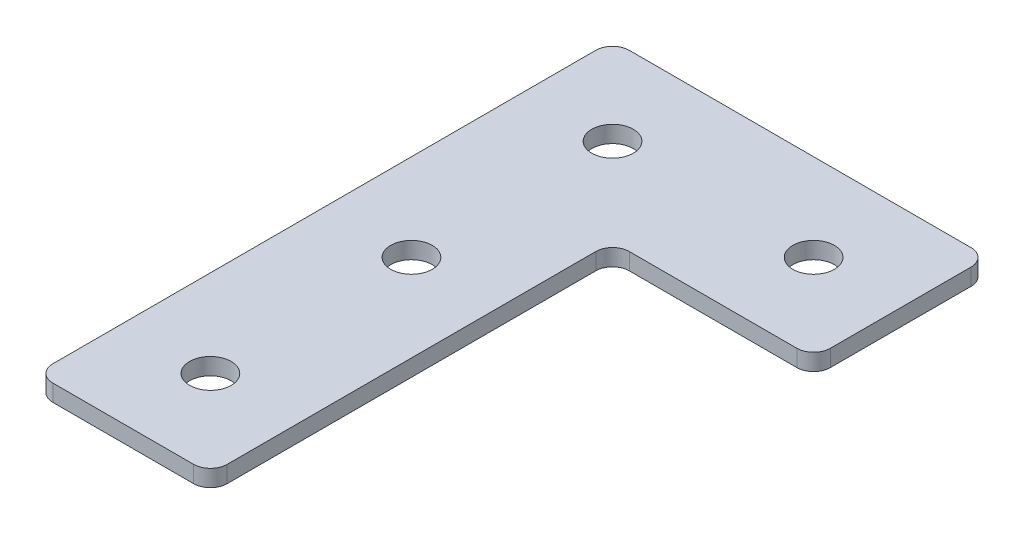
ISO-10303-21;
HEADER;
FILE_DESCRIPTION(('STEP AP214'),'2;1');
FILE_NAME('part.step','',(''),(''),'','','');
FILE_SCHEMA(('AUTOMOTIVE_DESIGN { 1 0 10303 214 1 1 1 1 }'));
ENDSEC;
DATA;
#1=APPLICATION_CONTEXT('core data for automotive mechanical design processes');
#2=APPLICATION_PROTOCOL_DEFINITION('international standard','automotive_design',2000,#1);
#3=PRODUCT_CONTEXT('',#1,'mechanical');
#4=PRODUCT('Part','Part','',(#3));
#5=PRODUCT_RELATED_PRODUCT_CATEGORY('part','',(#4));
#6=PRODUCT_DEFINITION_FORMATION('','',#4);
#7=PRODUCT_DEFINITION_CONTEXT('part definition',#1,'design');
#8=PRODUCT_DEFINITION('design','',#6,#7);
#9=PRODUCT_DEFINITION_SHAPE('','',#8);
#10=(LENGTH_UNIT() NAMED_UNIT(*) SI_UNIT(.MILLI.,.METRE.));
#11=(NAMED_UNIT(*) PLANE_ANGLE_UNIT() SI_UNIT($,.RADIAN.));
#12=(NAMED_UNIT(*) SI_UNIT($,.STERADIAN.) SOLID_ANGLE_UNIT());
#13=UNCERTAINTY_MEASURE_WITH_UNIT(LENGTH_MEASURE(1.E-05),#10,'distance_accuracy_value','');
#14=(GEOMETRIC_REPRESENTATION_CONTEXT(3) GLOBAL_UNCERTAINTY_ASSIGNED_CONTEXT((#13)) GLOBAL_UNIT_ASSIGNED_CONTEXT((#10,
#11,#12)) REPRESENTATION_CONTEXT('',''));
#15=CARTESIAN_POINT('',(0.,0.,0.));
#16=DIRECTION('',(0.,0.,1.));
#17=DIRECTION('',(1.,0.,0.));
#18=AXIS2_PLACEMENT_3D('',#15,#16,#17);
#19=CARTESIAN_POINT('',(-16.2659080191496,1.45798729371791,-31.4416391865665));
#20=DIRECTION('',(0.,-1.,0.));
#21=DIRECTION('',(0.,0.,-1.));
#22=AXIS2_PLACEMENT_3D('',#19,#20,#21);
#23=PLANE('',#22);
#24=CARTESIAN_POINT('',(-16.2659080191496,1.45798729371791,28.5583608134334));
#25=DIRECTION('',(0.,1.,0.));
#26=DIRECTION('',(0.,0.,1.));
#27=AXIS2_PLACEMENT_3D('',#24,#25,#26);
#28=CIRCLE('',#27,3.1);
#29=CARTESIAN_POINT('',(-16.2659080191496,1.45798729371791,31.6583608134335));
#30=VERTEX_POINT('',#29);
#31=EDGE_CURVE('E323',#30,#30,#28,.T.);
#32=ORIENTED_EDGE('',*,*,#31,.T.);
#33=EDGE_LOOP('',(#32));
#34=FACE_BOUND('',#33,.T.);
#35=CARTESIAN_POINT('',(-16.2659080191496,1.45798729371791,-1.44163918656655));
#36=DIRECTION('',(0.,1.,0.));
#37=DIRECTION('',(0.,0.,1.));
#38=AXIS2_PLACEMENT_3D('',#35,#36,#37);
#39=CIRCLE('',#38,3.1);
#40=CARTESIAN_POINT('',(-16.2659080191496,1.45798729371791,1.65836081343345));
#41=VERTEX_POINT('',#40);
#42=EDGE_CURVE('E319',#41,#41,#39,.T.);
#43=ORIENTED_EDGE('',*,*,#42,.T.);
#44=EDGE_LOOP('',(#43));
#45=FACE_BOUND('',#44,.T.);
#46=CARTESIAN_POINT('',(13.7340919808504,1.45798729371791,-31.4416391865665));
#47=DIRECTION('',(0.,1.,0.));
#48=DIRECTION('',(0.,0.,1.));
#49=AXIS2_PLACEMENT_3D('',#46,#47,#48);
#50=CIRCLE('',#49,3.1);
#51=CARTESIAN_POINT('',(13.7340919808504,1.45798729371791,-28.3416391865665));
#52=VERTEX_POINT('',#51);
#53=EDGE_CURVE('E313',#52,#52,#50,.T.);
#54=ORIENTED_EDGE('',*,*,#53,.T.);
#55=EDGE_LOOP('',(#54));
#56=FACE_BOUND('',#55,.T.);
#57=CARTESIAN_POINT('',(-16.2659080191496,1.45798729371791,-31.4416391865665));
#58=DIRECTION('',(0.,1.,0.));
#59=DIRECTION('',(0.,0.,1.));
#60=AXIS2_PLACEMENT_3D('',#57,#58,#59);
#61=CIRCLE('',#60,3.1);
#62=CARTESIAN_POINT('',(-16.2659080191496,1.45798729371791,-28.3416391865665));
#63=VERTEX_POINT('',#62);
#64=EDGE_CURVE('E187',#63,#63,#61,.T.);
#65=ORIENTED_EDGE('',*,*,#64,.T.);
#66=EDGE_LOOP('',(#65));
#67=FACE_BOUND('',#66,.T.);
#68=DIRECTION('',(-1.,0.,0.));
#69=VECTOR('',#68,1.);
#70=CARTESIAN_POINT('',(26.7340919808503,1.45798729371791,-44.4416391865666));
#71=LINE('',#70,#69);
#72=CARTESIAN_POINT('',(24.2340919808503,1.45798729371791,-44.4416391865666));
#73=VERTEX_POINT('',#72);
#74=CARTESIAN_POINT('',(-26.7659080191497,1.45798729371791,-44.4416391865666));
#75=VERTEX_POINT('',#74);
#76=EDGE_CURVE('E208',#73,#75,#71,.T.);
#77=ORIENTED_EDGE('',*,*,#76,.F.);
#78=CARTESIAN_POINT('',(24.2340919808503,1.45798729371791,-41.9416391865666));
#79=DIRECTION('',(0.,-1.,0.));
#80=DIRECTION('',(0.,0.,-1.));
#81=AXIS2_PLACEMENT_3D('',#78,#79,#80);
#82=CIRCLE('',#81,2.5);
#83=CARTESIAN_POINT('',(26.7340919808503,1.45798729371791,-41.9416391865666));
#84=VERTEX_POINT('',#83);
#85=EDGE_CURVE('E159',#73,#84,#82,.T.);
#86=ORIENTED_EDGE('',*,*,#85,.T.);
#87=DIRECTION('',(0.,0.,-1.));
#88=VECTOR('',#87,1.);
#89=CARTESIAN_POINT('',(26.7340919808503,1.45798729371791,-18.4416391865665));
#90=LINE('',#89,#88);
#91=CARTESIAN_POINT('',(26.7340919808503,1.45798729371791,-20.9416391865665));
#92=VERTEX_POINT('',#91);
#93=EDGE_CURVE('E217',#92,#84,#90,.T.);
#94=ORIENTED_EDGE('',*,*,#93,.F.);
#95=CARTESIAN_POINT('',(24.2340919808503,1.45798729371791,-20.9416391865665));
#96=DIRECTION('',(0.,-1.,0.));
#97=DIRECTION('',(0.,0.,-1.));
#98=AXIS2_PLACEMENT_3D('',#95,#96,#97);
#99=CIRCLE('',#98,2.5);
#100=CARTESIAN_POINT('',(24.2340919808503,1.45798729371791,-18.4416391865665));
#101=VERTEX_POINT('',#100);
#102=EDGE_CURVE('E131',#92,#101,#99,.T.);
#103=ORIENTED_EDGE('',*,*,#102,.T.);
#104=DIRECTION('',(1.,0.,0.));
#105=VECTOR('',#104,1.);
#106=CARTESIAN_POINT('',(-3.2659080191495,1.45798729371791,-18.4416391865665));
#107=LINE('',#106,#105);
#108=CARTESIAN_POINT('',(-0.765908019149499,1.45798729371791,-18.4416391865665));
#109=VERTEX_POINT('',#108);
#110=EDGE_CURVE('E194',#109,#101,#107,.T.);
#111=ORIENTED_EDGE('',*,*,#110,.F.);
#112=CARTESIAN_POINT('',(-0.765908019149499,1.45798729371791,-15.9416391865665));
#113=DIRECTION('',(0.,-1.,0.));
#114=DIRECTION('',(0.,0.,-1.));
#115=AXIS2_PLACEMENT_3D('',#112,#113,#114);
#116=CIRCLE('',#115,2.5);
#117=CARTESIAN_POINT('',(-3.2659080191495,1.45798729371791,-15.9416391865665));
#118=VERTEX_POINT('',#117);
#119=EDGE_CURVE('E10',#109,#118,#116,.F.);
#120=ORIENTED_EDGE('',*,*,#119,.T.);
#121=DIRECTION('',(0.,0.,-1.));
#122=VECTOR('',#121,1.);
#123=CARTESIAN_POINT('',(-3.2659080191495,1.45798729371791,41.5583608134334));
#124=LINE('',#123,#122);
#125=CARTESIAN_POINT('',(-3.2659080191495,1.45798729371791,39.0583608134334));
#126=VERTEX_POINT('',#125);
#127=EDGE_CURVE('E132',#126,#118,#124,.T.);
#128=ORIENTED_EDGE('',*,*,#127,.F.);
#129=CARTESIAN_POINT('',(-5.7659080191495,1.45798729371791,39.0583608134334));
#130=DIRECTION('',(0.,-1.,0.));
#131=DIRECTION('',(0.,0.,-1.));
#132=AXIS2_PLACEMENT_3D('',#129,#130,#131);
#133=CIRCLE('',#132,2.5);
#134=CARTESIAN_POINT('',(-5.7659080191495,1.45798729371791,41.5583608134334));
#135=VERTEX_POINT('',#134);
#136=EDGE_CURVE('E153',#126,#135,#133,.T.);
#137=ORIENTED_EDGE('',*,*,#136,.T.);
#138=DIRECTION('',(1.,0.,0.));
#139=VECTOR('',#138,1.);
#140=CARTESIAN_POINT('',(-29.2659080191497,1.45798729371791,41.5583608134334));
#141=LINE('',#140,#139);
#142=CARTESIAN_POINT('',(-26.7659080191497,1.45798729371791,41.5583608134334));
#143=VERTEX_POINT('',#142);
#144=EDGE_CURVE('E136',#143,#135,#141,.T.);
#145=ORIENTED_EDGE('',*,*,#144,.F.);
#146=CARTESIAN_POINT('',(-26.7659080191497,1.45798729371791,39.0583608134334));
#147=DIRECTION('',(0.,-1.,0.));
#148=DIRECTION('',(0.,0.,-1.));
#149=AXIS2_PLACEMENT_3D('',#146,#147,#148);
#150=CIRCLE('',#149,2.5);
#151=CARTESIAN_POINT('',(-29.2659080191497,1.45798729371791,39.0583608134334));
#152=VERTEX_POINT('',#151);
#153=EDGE_CURVE('E31',#143,#152,#150,.T.);
#154=ORIENTED_EDGE('',*,*,#153,.T.);
#155=DIRECTION('',(0.,0.,1.));
#156=VECTOR('',#155,1.);
#157=CARTESIAN_POINT('',(-29.2659080191497,1.45798729371791,-44.4416391865666));
#158=LINE('',#157,#156);
#159=CARTESIAN_POINT('',(-29.2659080191497,1.45798729371791,-41.9416391865666));
#160=VERTEX_POINT('',#159);
#161=EDGE_CURVE('E206',#160,#152,#158,.T.);
#162=ORIENTED_EDGE('',*,*,#161,.F.);
#163=CARTESIAN_POINT('',(-26.7659080191497,1.45798729371791,-41.9416391865666));
#164=DIRECTION('',(0.,-1.,0.));
#165=DIRECTION('',(0.,0.,-1.));
#166=AXIS2_PLACEMENT_3D('',#163,#164,#165);
#167=CIRCLE('',#166,2.5);
#168=EDGE_CURVE('E157',#160,#75,#167,.T.);
#169=ORIENTED_EDGE('',*,*,#168,.T.);
#170=EDGE_LOOP('',(#77,#86,#94,#103,#111,#120,#128,#137,#145,#154,#162,#169));
#171=FACE_BOUND('',#170,.T.);
#172=ADVANCED_FACE('F16',(#34,#45,#56,#67,#171),#23,.T.);
#173=CARTESIAN_POINT('',(-3.2659080191495,1.45798729371791,-18.4416391865665));
#174=DIRECTION('',(0.,0.,1.));
#175=DIRECTION('',(1.,0.,0.));
#176=AXIS2_PLACEMENT_3D('',#173,#174,#175);
#177=PLANE('',#176);
#178=DIRECTION('',(1.,0.,0.));
#179=VECTOR('',#178,1.);
#180=CARTESIAN_POINT('',(-3.2659080191495,3.95798729371791,-18.4416391865665));
#181=LINE('',#180,#179);
#182=CARTESIAN_POINT('',(-0.765908019149499,3.95798729371791,-18.4416391865665));
#183=VERTEX_POINT('',#182);
#184=CARTESIAN_POINT('',(24.2340919808503,3.95798729371791,-18.4416391865665));
#185=VERTEX_POINT('',#184);
#186=EDGE_CURVE('E111',#183,#185,#181,.T.);
#187=ORIENTED_EDGE('',*,*,#186,.F.);
#188=DIRECTION('',(0.,1.,0.));
#189=VECTOR('',#188,1.);
#190=CARTESIAN_POINT('',(-0.765908019149499,1.45798729371791,-18.4416391865665));
#191=LINE('',#190,#189);
#192=EDGE_CURVE('E177',#183,#109,#191,.F.);
#193=ORIENTED_EDGE('',*,*,#192,.T.);
#194=ORIENTED_EDGE('',*,*,#110,.T.);
#195=DIRECTION('',(0.,1.,0.));
#196=VECTOR('',#195,1.);
#197=CARTESIAN_POINT('',(24.2340919808503,1.45798729371791,-18.4416391865665));
#198=LINE('',#197,#196);
#199=EDGE_CURVE('E175',#101,#185,#198,.T.);
#200=ORIENTED_EDGE('',*,*,#199,.T.);
#201=EDGE_LOOP('',(#187,#193,#194,#200));
#202=FACE_BOUND('',#201,.T.);
#203=ADVANCED_FACE('F184',(#202),#177,.T.);
#204=CARTESIAN_POINT('',(-3.2659080191495,1.45798729371791,41.5583608134334));
#205=DIRECTION('',(1.,0.,0.));
#206=DIRECTION('',(0.,0.,-1.));
#207=AXIS2_PLACEMENT_3D('',#204,#205,#206);
#208=PLANE('',#207);
#209=ORIENTED_EDGE('',*,*,#127,.T.);
#210=DIRECTION('',(0.,1.,0.));
#211=VECTOR('',#210,1.);
#212=CARTESIAN_POINT('',(-3.2659080191495,3.95798729371791,-15.9416391865665));
#213=LINE('',#212,#211);
#214=CARTESIAN_POINT('',(-3.2659080191495,3.95798729371791,-15.9416391865665));
#215=VERTEX_POINT('',#214);
#216=EDGE_CURVE('E172',#118,#215,#213,.T.);
#217=ORIENTED_EDGE('',*,*,#216,.T.);
#218=DIRECTION('',(0.,0.,-1.));
#219=VECTOR('',#218,1.);
#220=CARTESIAN_POINT('',(-3.2659080191495,3.95798729371791,41.5583608134334));
#221=LINE('',#220,#219);
#222=CARTESIAN_POINT('',(-3.2659080191495,3.95798729371791,39.0583608134334));
#223=VERTEX_POINT('',#222);
#224=EDGE_CURVE('E139',#223,#215,#221,.T.);
#225=ORIENTED_EDGE('',*,*,#224,.F.);
#226=DIRECTION('',(0.,1.,0.));
#227=VECTOR('',#226,1.);
#228=CARTESIAN_POINT('',(-3.2659080191495,1.45798729371791,39.0583608134334));
#229=LINE('',#228,#227);
#230=EDGE_CURVE('E170',#223,#126,#229,.F.);
#231=ORIENTED_EDGE('',*,*,#230,.T.);
#232=EDGE_LOOP('',(#209,#217,#225,#231));
#233=FACE_BOUND('',#232,.T.);
#234=ADVANCED_FACE('F196',(#233),#208,.T.);
#235=CARTESIAN_POINT('',(-29.2659080191497,1.45798729371791,41.5583608134334));
#236=DIRECTION('',(0.,0.,1.));
#237=DIRECTION('',(1.,0.,0.));
#238=AXIS2_PLACEMENT_3D('',#235,#236,#237);
#239=PLANE('',#238);
#240=DIRECTION('',(1.,0.,0.));
#241=VECTOR('',#240,1.);
#242=CARTESIAN_POINT('',(-29.2659080191497,3.95798729371791,41.5583608134334));
#243=LINE('',#242,#241);
#244=CARTESIAN_POINT('',(-26.7659080191497,3.95798729371791,41.5583608134334));
#245=VERTEX_POINT('',#244);
#246=CARTESIAN_POINT('',(-5.7659080191495,3.95798729371791,41.5583608134334));
#247=VERTEX_POINT('',#246);
#248=EDGE_CURVE('E216',#245,#247,#243,.T.);
#249=ORIENTED_EDGE('',*,*,#248,.F.);
#250=DIRECTION('',(0.,1.,0.));
#251=VECTOR('',#250,1.);
#252=CARTESIAN_POINT('',(-26.7659080191497,1.45798729371791,41.5583608134334));
#253=LINE('',#252,#251);
#254=EDGE_CURVE('E168',#245,#143,#253,.F.);
#255=ORIENTED_EDGE('',*,*,#254,.T.);
#256=ORIENTED_EDGE('',*,*,#144,.T.);
#257=DIRECTION('',(0.,1.,0.));
#258=VECTOR('',#257,1.);
#259=CARTESIAN_POINT('',(-5.7659080191495,1.45798729371791,41.5583608134334));
#260=LINE('',#259,#258);
#261=EDGE_CURVE('E165',#135,#247,#260,.T.);
#262=ORIENTED_EDGE('',*,*,#261,.T.);
#263=EDGE_LOOP('',(#249,#255,#256,#262));
#264=FACE_BOUND('',#263,.T.);
#265=ADVANCED_FACE('F203',(#264),#239,.T.);
#266=CARTESIAN_POINT('',(-29.2659080191497,1.45798729371791,-44.4416391865666));
#267=DIRECTION('',(-1.,0.,0.));
#268=DIRECTION('',(0.,0.,1.));
#269=AXIS2_PLACEMENT_3D('',#266,#267,#268);
#270=PLANE('',#269);
#271=DIRECTION('',(0.,0.,1.));
#272=VECTOR('',#271,1.);
#273=CARTESIAN_POINT('',(-29.2659080191497,3.95798729371791,-44.4416391865666));
#274=LINE('',#273,#272);
#275=CARTESIAN_POINT('',(-29.2659080191497,3.95798729371791,-41.9416391865666));
#276=VERTEX_POINT('',#275);
#277=CARTESIAN_POINT('',(-29.2659080191497,3.95798729371791,39.0583608134334));
#278=VERTEX_POINT('',#277);
#279=EDGE_CURVE('E214',#276,#278,#274,.T.);
#280=ORIENTED_EDGE('',*,*,#279,.F.);
#281=DIRECTION('',(0.,1.,0.));
#282=VECTOR('',#281,1.);
#283=CARTESIAN_POINT('',(-29.2659080191497,1.45798729371791,-41.9416391865666));
#284=LINE('',#283,#282);
#285=EDGE_CURVE('E38',#276,#160,#284,.F.);
#286=ORIENTED_EDGE('',*,*,#285,.T.);
#287=ORIENTED_EDGE('',*,*,#161,.T.);
#288=DIRECTION('',(0.,1.,0.));
#289=VECTOR('',#288,1.);
#290=CARTESIAN_POINT('',(-29.2659080191497,1.45798729371791,39.0583608134334));
#291=LINE('',#290,#289);
#292=EDGE_CURVE('E161',#152,#278,#291,.T.);
#293=ORIENTED_EDGE('',*,*,#292,.T.);
#294=EDGE_LOOP('',(#280,#286,#287,#293));
#295=FACE_BOUND('',#294,.T.);
#296=ADVANCED_FACE('F233',(#295),#270,.T.);
#297=CARTESIAN_POINT('',(26.7340919808503,1.45798729371791,-44.4416391865666));
#298=DIRECTION('',(0.,0.,-1.));
#299=DIRECTION('',(-1.,0.,0.));
#300=AXIS2_PLACEMENT_3D('',#297,#298,#299);
#301=PLANE('',#300);
#302=DIRECTION('',(-1.,0.,0.));
#303=VECTOR('',#302,1.);
#304=CARTESIAN_POINT('',(26.7340919808503,3.95798729371791,-44.4416391865666));
#305=LINE('',#304,#303);
#306=CARTESIAN_POINT('',(24.2340919808503,3.95798729371791,-44.4416391865666));
#307=VERTEX_POINT('',#306);
#308=CARTESIAN_POINT('',(-26.7659080191497,3.95798729371791,-44.4416391865666));
#309=VERTEX_POINT('',#308);
#310=EDGE_CURVE('E127',#307,#309,#305,.T.);
#311=ORIENTED_EDGE('',*,*,#310,.F.);
#312=DIRECTION('',(0.,1.,0.));
#313=VECTOR('',#312,1.);
#314=CARTESIAN_POINT('',(24.2340919808503,1.45798729371791,-44.4416391865666));
#315=LINE('',#314,#313);
#316=EDGE_CURVE('E151',#307,#73,#315,.F.);
#317=ORIENTED_EDGE('',*,*,#316,.T.);
#318=ORIENTED_EDGE('',*,*,#76,.T.);
#319=DIRECTION('',(0.,1.,0.));
#320=VECTOR('',#319,1.);
#321=CARTESIAN_POINT('',(-26.7659080191497,1.45798729371791,-44.4416391865666));
#322=LINE('',#321,#320);
#323=EDGE_CURVE('E148',#75,#309,#322,.T.);
#324=ORIENTED_EDGE('',*,*,#323,.T.);
#325=EDGE_LOOP('',(#311,#317,#318,#324));
#326=FACE_BOUND('',#325,.T.);
#327=ADVANCED_FACE('F227',(#326),#301,.T.);
#328=CARTESIAN_POINT('',(26.7340919808503,1.45798729371791,-18.4416391865665));
#329=DIRECTION('',(1.,0.,0.));
#330=DIRECTION('',(0.,0.,-1.));
#331=AXIS2_PLACEMENT_3D('',#328,#329,#330);
#332=PLANE('',#331);
#333=ORIENTED_EDGE('',*,*,#93,.T.);
#334=DIRECTION('',(0.,1.,0.));
#335=VECTOR('',#334,1.);
#336=CARTESIAN_POINT('',(26.7340919808503,1.45798729371791,-41.9416391865666));
#337=LINE('',#336,#335);
#338=CARTESIAN_POINT('',(26.7340919808503,3.95798729371791,-41.9416391865666));
#339=VERTEX_POINT('',#338);
#340=EDGE_CURVE('E126',#84,#339,#337,.T.);
#341=ORIENTED_EDGE('',*,*,#340,.T.);
#342=DIRECTION('',(0.,0.,-1.));
#343=VECTOR('',#342,1.);
#344=CARTESIAN_POINT('',(26.7340919808503,3.95798729371791,-18.4416391865665));
#345=LINE('',#344,#343);
#346=CARTESIAN_POINT('',(26.7340919808503,3.95798729371791,-20.9416391865665));
#347=VERTEX_POINT('',#346);
#348=EDGE_CURVE('E109',#347,#339,#345,.T.);
#349=ORIENTED_EDGE('',*,*,#348,.F.);
#350=DIRECTION('',(0.,1.,0.));
#351=VECTOR('',#350,1.);
#352=CARTESIAN_POINT('',(26.7340919808503,1.45798729371791,-20.9416391865665));
#353=LINE('',#352,#351);
#354=EDGE_CURVE('E123',#347,#92,#353,.F.);
#355=ORIENTED_EDGE('',*,*,#354,.T.);
#356=EDGE_LOOP('',(#333,#341,#349,#355));
#357=FACE_BOUND('',#356,.T.);
#358=ADVANCED_FACE('F122',(#357),#332,.T.);
#359=CARTESIAN_POINT('',(-16.2659080191496,3.95798729371791,-31.4416391865665));
#360=DIRECTION('',(0.,-1.,0.));
#361=DIRECTION('',(0.,0.,-1.));
#362=AXIS2_PLACEMENT_3D('',#359,#360,#361);
#363=PLANE('',#362);
#364=CARTESIAN_POINT('',(-16.2659080191496,3.95798729371791,28.5583608134334));
#365=DIRECTION('',(0.,1.,0.));
#366=DIRECTION('',(0.,0.,1.));
#367=AXIS2_PLACEMENT_3D('',#364,#365,#366);
#368=CIRCLE('',#367,3.1);
#369=CARTESIAN_POINT('',(-16.2659080191496,3.95798729371791,31.6583608134335));
#370=VERTEX_POINT('',#369);
#371=EDGE_CURVE('E301',#370,#370,#368,.T.);
#372=ORIENTED_EDGE('',*,*,#371,.F.);
#373=EDGE_LOOP('',(#372));
#374=FACE_BOUND('',#373,.T.);
#375=CARTESIAN_POINT('',(-16.2659080191496,3.95798729371791,-1.44163918656655));
#376=DIRECTION('',(0.,1.,0.));
#377=DIRECTION('',(0.,0.,1.));
#378=AXIS2_PLACEMENT_3D('',#375,#376,#377);
#379=CIRCLE('',#378,3.1);
#380=CARTESIAN_POINT('',(-16.2659080191496,3.95798729371791,1.65836081343345));
#381=VERTEX_POINT('',#380);
#382=EDGE_CURVE('E305',#381,#381,#379,.T.);
#383=ORIENTED_EDGE('',*,*,#382,.F.);
#384=EDGE_LOOP('',(#383));
#385=FACE_BOUND('',#384,.T.);
#386=CARTESIAN_POINT('',(13.7340919808504,3.95798729371791,-31.4416391865665));
#387=DIRECTION('',(0.,1.,0.));
#388=DIRECTION('',(0.,0.,1.));
#389=AXIS2_PLACEMENT_3D('',#386,#387,#388);
#390=CIRCLE('',#389,3.1);
#391=CARTESIAN_POINT('',(13.7340919808504,3.95798729371791,-28.3416391865665));
#392=VERTEX_POINT('',#391);
#393=EDGE_CURVE('E309',#392,#392,#390,.T.);
#394=ORIENTED_EDGE('',*,*,#393,.F.);
#395=EDGE_LOOP('',(#394));
#396=FACE_BOUND('',#395,.T.);
#397=CARTESIAN_POINT('',(-16.2659080191496,3.95798729371791,-31.4416391865665));
#398=DIRECTION('',(0.,1.,0.));
#399=DIRECTION('',(0.,0.,1.));
#400=AXIS2_PLACEMENT_3D('',#397,#398,#399);
#401=CIRCLE('',#400,3.1);
#402=CARTESIAN_POINT('',(-16.2659080191496,3.95798729371791,-28.3416391865665));
#403=VERTEX_POINT('',#402);
#404=EDGE_CURVE('E221',#403,#403,#401,.T.);
#405=ORIENTED_EDGE('',*,*,#404,.F.);
#406=EDGE_LOOP('',(#405));
#407=FACE_BOUND('',#406,.T.);
#408=ORIENTED_EDGE('',*,*,#348,.T.);
#409=CARTESIAN_POINT('',(24.2340919808503,3.95798729371791,-41.9416391865666));
#410=DIRECTION('',(0.,-1.,0.));
#411=DIRECTION('',(0.,0.,-1.));
#412=AXIS2_PLACEMENT_3D('',#409,#410,#411);
#413=CIRCLE('',#412,2.5);
#414=EDGE_CURVE('E146',#339,#307,#413,.F.);
#415=ORIENTED_EDGE('',*,*,#414,.T.);
#416=ORIENTED_EDGE('',*,*,#310,.T.);
#417=CARTESIAN_POINT('',(-26.7659080191497,3.95798729371791,-41.9416391865666));
#418=DIRECTION('',(0.,-1.,0.));
#419=DIRECTION('',(0.,0.,-1.));
#420=AXIS2_PLACEMENT_3D('',#417,#418,#419);
#421=CIRCLE('',#420,2.5);
#422=EDGE_CURVE('E144',#309,#276,#421,.F.);
#423=ORIENTED_EDGE('',*,*,#422,.T.);
#424=ORIENTED_EDGE('',*,*,#279,.T.);
#425=CARTESIAN_POINT('',(-26.7659080191497,3.95798729371791,39.0583608134334));
#426=DIRECTION('',(0.,-1.,0.));
#427=DIRECTION('',(0.,0.,-1.));
#428=AXIS2_PLACEMENT_3D('',#425,#426,#427);
#429=CIRCLE('',#428,2.5);
#430=EDGE_CURVE('E116',#278,#245,#429,.F.);
#431=ORIENTED_EDGE('',*,*,#430,.T.);
#432=ORIENTED_EDGE('',*,*,#248,.T.);
#433=CARTESIAN_POINT('',(-5.7659080191495,3.95798729371791,39.0583608134334));
#434=DIRECTION('',(0.,-1.,0.));
#435=DIRECTION('',(0.,0.,-1.));
#436=AXIS2_PLACEMENT_3D('',#433,#434,#435);
#437=CIRCLE('',#436,2.5);
#438=EDGE_CURVE('E117',#247,#223,#437,.F.);
#439=ORIENTED_EDGE('',*,*,#438,.T.);
#440=ORIENTED_EDGE('',*,*,#224,.T.);
#441=CARTESIAN_POINT('',(-0.765908019149499,3.95798729371791,-15.9416391865665));
#442=DIRECTION('',(0.,-1.,0.));
#443=DIRECTION('',(0.,0.,-1.));
#444=AXIS2_PLACEMENT_3D('',#441,#442,#443);
#445=CIRCLE('',#444,2.5);
#446=EDGE_CURVE('E24',#215,#183,#445,.T.);
#447=ORIENTED_EDGE('',*,*,#446,.T.);
#448=ORIENTED_EDGE('',*,*,#186,.T.);
#449=CARTESIAN_POINT('',(24.2340919808503,3.95798729371791,-20.9416391865665));
#450=DIRECTION('',(0.,-1.,0.));
#451=DIRECTION('',(0.,0.,-1.));
#452=AXIS2_PLACEMENT_3D('',#449,#450,#451);
#453=CIRCLE('',#452,2.5);
#454=EDGE_CURVE('E106',#185,#347,#453,.F.);
#455=ORIENTED_EDGE('',*,*,#454,.T.);
#456=EDGE_LOOP('',(#408,#415,#416,#423,#424,#431,#432,#439,#440,#447,#448,#455));
#457=FACE_BOUND('',#456,.T.);
#458=ADVANCED_FACE('F108',(#374,#385,#396,#407,#457),#363,.F.);
#459=CARTESIAN_POINT('',(-16.2659080191496,1.45798729371791,-31.4416391865665));
#460=DIRECTION('',(0.,1.,0.));
#461=DIRECTION('',(0.,0.,1.));
#462=AXIS2_PLACEMENT_3D('',#459,#460,#461);
#463=CYLINDRICAL_SURFACE('',#462,3.1);
#464=ORIENTED_EDGE('',*,*,#64,.F.);
#465=EDGE_LOOP('',(#464));
#466=FACE_BOUND('',#465,.T.);
#467=ORIENTED_EDGE('',*,*,#404,.T.);
#468=EDGE_LOOP('',(#467));
#469=FACE_BOUND('',#468,.T.);
#470=ADVANCED_FACE('F278',(#466,#469),#463,.F.);
#471=CARTESIAN_POINT('',(13.7340919808504,1.45798729371791,-31.4416391865665));
#472=DIRECTION('',(0.,1.,0.));
#473=DIRECTION('',(0.,0.,1.));
#474=AXIS2_PLACEMENT_3D('',#471,#472,#473);
#475=CYLINDRICAL_SURFACE('',#474,3.1);
#476=ORIENTED_EDGE('',*,*,#53,.F.);
#477=EDGE_LOOP('',(#476));
#478=FACE_BOUND('',#477,.T.);
#479=ORIENTED_EDGE('',*,*,#393,.T.);
#480=EDGE_LOOP('',(#479));
#481=FACE_BOUND('',#480,.T.);
#482=ADVANCED_FACE('F270',(#478,#481),#475,.F.);
#483=CARTESIAN_POINT('',(-16.2659080191496,1.45798729371791,-1.44163918656655));
#484=DIRECTION('',(0.,1.,0.));
#485=DIRECTION('',(0.,0.,1.));
#486=AXIS2_PLACEMENT_3D('',#483,#484,#485);
#487=CYLINDRICAL_SURFACE('',#486,3.1);
#488=ORIENTED_EDGE('',*,*,#42,.F.);
#489=EDGE_LOOP('',(#488));
#490=FACE_BOUND('',#489,.T.);
#491=ORIENTED_EDGE('',*,*,#382,.T.);
#492=EDGE_LOOP('',(#491));
#493=FACE_BOUND('',#492,.T.);
#494=ADVANCED_FACE('F264',(#490,#493),#487,.F.);
#495=CARTESIAN_POINT('',(-16.2659080191496,1.45798729371791,28.5583608134334));
#496=DIRECTION('',(0.,1.,0.));
#497=DIRECTION('',(0.,0.,1.));
#498=AXIS2_PLACEMENT_3D('',#495,#496,#497);
#499=CYLINDRICAL_SURFACE('',#498,3.1);
#500=ORIENTED_EDGE('',*,*,#31,.F.);
#501=EDGE_LOOP('',(#500));
#502=FACE_BOUND('',#501,.T.);
#503=ORIENTED_EDGE('',*,*,#371,.T.);
#504=EDGE_LOOP('',(#503));
#505=FACE_BOUND('',#504,.T.);
#506=ADVANCED_FACE('F259',(#502,#505),#499,.F.);
#507=CARTESIAN_POINT('',(24.2340919808503,1.45798729371791,-41.9416391865666));
#508=DIRECTION('',(0.,1.,0.));
#509=DIRECTION('',(0.,0.,1.));
#510=AXIS2_PLACEMENT_3D('',#507,#508,#509);
#511=CYLINDRICAL_SURFACE('',#510,2.5);
#512=ORIENTED_EDGE('',*,*,#85,.F.);
#513=ORIENTED_EDGE('',*,*,#316,.F.);
#514=ORIENTED_EDGE('',*,*,#414,.F.);
#515=ORIENTED_EDGE('',*,*,#340,.F.);
#516=EDGE_LOOP('',(#512,#513,#514,#515));
#517=FACE_BOUND('',#516,.T.);
#518=ADVANCED_FACE('F245',(#517),#511,.T.);
#519=CARTESIAN_POINT('',(-26.7659080191497,1.45798729371791,-41.9416391865666));
#520=DIRECTION('',(0.,1.,0.));
#521=DIRECTION('',(0.,0.,1.));
#522=AXIS2_PLACEMENT_3D('',#519,#520,#521);
#523=CYLINDRICAL_SURFACE('',#522,2.5);
#524=ORIENTED_EDGE('',*,*,#168,.F.);
#525=ORIENTED_EDGE('',*,*,#285,.F.);
#526=ORIENTED_EDGE('',*,*,#422,.F.);
#527=ORIENTED_EDGE('',*,*,#323,.F.);
#528=EDGE_LOOP('',(#524,#525,#526,#527));
#529=FACE_BOUND('',#528,.T.);
#530=ADVANCED_FACE('F232',(#529),#523,.T.);
#531=CARTESIAN_POINT('',(-26.7659080191497,1.45798729371791,39.0583608134334));
#532=DIRECTION('',(0.,1.,0.));
#533=DIRECTION('',(0.,0.,1.));
#534=AXIS2_PLACEMENT_3D('',#531,#532,#533);
#535=CYLINDRICAL_SURFACE('',#534,2.5);
#536=ORIENTED_EDGE('',*,*,#153,.F.);
#537=ORIENTED_EDGE('',*,*,#254,.F.);
#538=ORIENTED_EDGE('',*,*,#430,.F.);
#539=ORIENTED_EDGE('',*,*,#292,.F.);
#540=EDGE_LOOP('',(#536,#537,#538,#539));
#541=FACE_BOUND('',#540,.T.);
#542=ADVANCED_FACE('F236',(#541),#535,.T.);
#543=CARTESIAN_POINT('',(-0.765908019149499,1.45798729371791,-15.9416391865665));
#544=DIRECTION('',(0.,-1.,0.));
#545=DIRECTION('',(0.,0.,-1.));
#546=AXIS2_PLACEMENT_3D('',#543,#544,#545);
#547=CYLINDRICAL_SURFACE('',#546,2.5);
#548=ORIENTED_EDGE('',*,*,#119,.F.);
#549=ORIENTED_EDGE('',*,*,#192,.F.);
#550=ORIENTED_EDGE('',*,*,#446,.F.);
#551=ORIENTED_EDGE('',*,*,#216,.F.);
#552=EDGE_LOOP('',(#548,#549,#550,#551));
#553=FACE_BOUND('',#552,.T.);
#554=ADVANCED_FACE('F190',(#553),#547,.F.);
#555=CARTESIAN_POINT('',(24.2340919808503,1.45798729371791,-20.9416391865665));
#556=DIRECTION('',(0.,1.,0.));
#557=DIRECTION('',(0.,0.,1.));
#558=AXIS2_PLACEMENT_3D('',#555,#556,#557);
#559=CYLINDRICAL_SURFACE('',#558,2.5);
#560=ORIENTED_EDGE('',*,*,#102,.F.);
#561=ORIENTED_EDGE('',*,*,#354,.F.);
#562=ORIENTED_EDGE('',*,*,#454,.F.);
#563=ORIENTED_EDGE('',*,*,#199,.F.);
#564=EDGE_LOOP('',(#560,#561,#562,#563));
#565=FACE_BOUND('',#564,.T.);
#566=ADVANCED_FACE('F130',(#565),#559,.T.);
#567=CARTESIAN_POINT('',(-5.7659080191495,1.45798729371791,39.0583608134334));
#568=DIRECTION('',(0.,1.,0.));
#569=DIRECTION('',(0.,0.,1.));
#570=AXIS2_PLACEMENT_3D('',#567,#568,#569);
#571=CYLINDRICAL_SURFACE('',#570,2.5);
#572=ORIENTED_EDGE('',*,*,#136,.F.);
#573=ORIENTED_EDGE('',*,*,#230,.F.);
#574=ORIENTED_EDGE('',*,*,#438,.F.);
#575=ORIENTED_EDGE('',*,*,#261,.F.);
#576=EDGE_LOOP('',(#572,#573,#574,#575));
#577=FACE_BOUND('',#576,.T.);
#578=ADVANCED_FACE('F18',(#577),#571,.T.);
#579=CLOSED_SHELL('',(#172,#203,#234,#265,#296,#327,#358,#458,#470,#482,#494,#506,#518,#530,
#542,#554,#566,#578));
#580=MANIFOLD_SOLID_BREP('B1',#579);
#581=ADVANCED_BREP_SHAPE_REPRESENTATION('',(#18,#580),#14);
#582=SHAPE_DEFINITION_REPRESENTATION(#9,#581);
ENDSEC;
END-ISO-10303-21;
